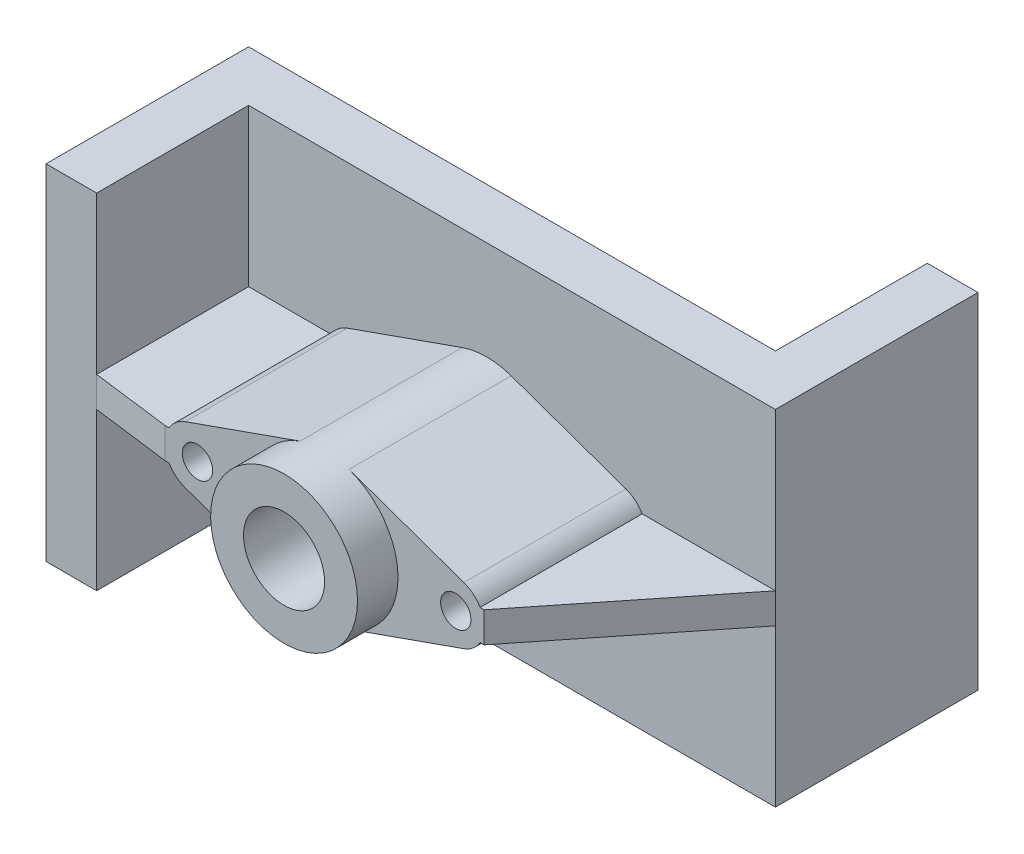
ISO-10303-21;
HEADER;
FILE_DESCRIPTION(('STEP AP214'),'2;1');
FILE_NAME('part.step','',(''),(''),'','','');
FILE_SCHEMA(('AUTOMOTIVE_DESIGN { 1 0 10303 214 1 1 1 1 }'));
ENDSEC;
DATA;
#1=APPLICATION_CONTEXT('core data for automotive mechanical design processes');
#2=APPLICATION_PROTOCOL_DEFINITION('international standard','automotive_design',2000,#1);
#3=PRODUCT_CONTEXT('',#1,'mechanical');
#4=PRODUCT('Part','Part','',(#3));
#5=PRODUCT_RELATED_PRODUCT_CATEGORY('part','',(#4));
#6=PRODUCT_DEFINITION_FORMATION('','',#4);
#7=PRODUCT_DEFINITION_CONTEXT('part definition',#1,'design');
#8=PRODUCT_DEFINITION('design','',#6,#7);
#9=PRODUCT_DEFINITION_SHAPE('','',#8);
#10=(LENGTH_UNIT() NAMED_UNIT(*) SI_UNIT(.MILLI.,.METRE.));
#11=(NAMED_UNIT(*) PLANE_ANGLE_UNIT() SI_UNIT($,.RADIAN.));
#12=(NAMED_UNIT(*) SI_UNIT($,.STERADIAN.) SOLID_ANGLE_UNIT());
#13=UNCERTAINTY_MEASURE_WITH_UNIT(LENGTH_MEASURE(1.E-05),#10,'distance_accuracy_value','');
#14=(GEOMETRIC_REPRESENTATION_CONTEXT(3) GLOBAL_UNCERTAINTY_ASSIGNED_CONTEXT((#13)) GLOBAL_UNIT_ASSIGNED_CONTEXT((#10,
#11,#12)) REPRESENTATION_CONTEXT('',''));
#15=CARTESIAN_POINT('',(0.,0.,0.));
#16=DIRECTION('',(0.,0.,1.));
#17=DIRECTION('',(1.,0.,0.));
#18=AXIS2_PLACEMENT_3D('',#15,#16,#17);
#19=CARTESIAN_POINT('',(-47.,34.,-10.));
#20=DIRECTION('',(0.,0.,-1.));
#21=DIRECTION('',(-1.,0.,0.));
#22=AXIS2_PLACEMENT_3D('',#19,#20,#21);
#23=PLANE('',#22);
#24=DIRECTION('',(1.,0.,0.));
#25=VECTOR('',#24,1.);
#26=CARTESIAN_POINT('',(-47.,-3.,-10.));
#27=LINE('',#26,#25);
#28=CARTESIAN_POINT('',(-47.,-3.,-10.));
#29=VERTEX_POINT('',#28);
#30=CARTESIAN_POINT('',(-30.6961524227066,-3.,-10.));
#31=VERTEX_POINT('',#30);
#32=EDGE_CURVE('E53',#29,#31,#27,.T.);
#33=ORIENTED_EDGE('',*,*,#32,.F.);
#34=DIRECTION('',(0.,-1.,0.));
#35=VECTOR('',#34,1.);
#36=CARTESIAN_POINT('',(-47.,34.,-10.));
#37=LINE('',#36,#35);
#38=CARTESIAN_POINT('',(-47.,-34.,-10.));
#39=VERTEX_POINT('',#38);
#40=EDGE_CURVE('E407',#29,#39,#37,.T.);
#41=ORIENTED_EDGE('',*,*,#40,.T.);
#42=DIRECTION('',(1.,0.,0.));
#43=VECTOR('',#42,1.);
#44=CARTESIAN_POINT('',(-47.,-34.,-10.));
#45=LINE('',#44,#43);
#46=CARTESIAN_POINT('',(57.,-34.,-10.));
#47=VERTEX_POINT('',#46);
#48=EDGE_CURVE('E387',#39,#47,#45,.T.);
#49=ORIENTED_EDGE('',*,*,#48,.T.);
#50=DIRECTION('',(0.,-1.,0.));
#51=VECTOR('',#50,1.);
#52=CARTESIAN_POINT('',(57.,34.,-10.));
#53=LINE('',#52,#51);
#54=CARTESIAN_POINT('',(57.,-3.,-10.));
#55=VERTEX_POINT('',#54);
#56=EDGE_CURVE('E403',#55,#47,#53,.T.);
#57=ORIENTED_EDGE('',*,*,#56,.F.);
#58=DIRECTION('',(1.,0.,0.));
#59=VECTOR('',#58,1.);
#60=CARTESIAN_POINT('',(-47.,-3.,-10.));
#61=LINE('',#60,#59);
#62=CARTESIAN_POINT('',(30.6961524227066,-3.,-10.));
#63=VERTEX_POINT('',#62);
#64=EDGE_CURVE('E262',#63,#55,#61,.T.);
#65=ORIENTED_EDGE('',*,*,#64,.F.);
#66=CARTESIAN_POINT('',(25.5,0.,-10.));
#67=DIRECTION('',(0.,0.,1.));
#68=DIRECTION('',(1.,0.,0.));
#69=AXIS2_PLACEMENT_3D('',#66,#67,#68);
#70=CIRCLE('',#69,6.);
#71=CARTESIAN_POINT('',(27.5,-5.65685424949238,-10.));
#72=VERTEX_POINT('',#71);
#73=EDGE_CURVE('E321',#72,#63,#70,.T.);
#74=ORIENTED_EDGE('',*,*,#73,.F.);
#75=DIRECTION('',(0.942809041582063,0.333333333333333,0.));
#76=VECTOR('',#75,1.);
#77=CARTESIAN_POINT('',(4.83333333333333,-13.6707311029399,-10.));
#78=LINE('',#77,#76);
#79=CARTESIAN_POINT('',(4.83333333333333,-13.6707311029399,-10.));
#80=VERTEX_POINT('',#79);
#81=EDGE_CURVE('E317',#80,#72,#78,.T.);
#82=ORIENTED_EDGE('',*,*,#81,.F.);
#83=CARTESIAN_POINT('',(0.,0.,-10.));
#84=DIRECTION('',(0.,0.,1.));
#85=DIRECTION('',(1.,0.,0.));
#86=AXIS2_PLACEMENT_3D('',#83,#84,#85);
#87=CIRCLE('',#86,14.5);
#88=CARTESIAN_POINT('',(-4.83333333333334,-13.6707311029399,-10.));
#89=VERTEX_POINT('',#88);
#90=EDGE_CURVE('E314',#89,#80,#87,.T.);
#91=ORIENTED_EDGE('',*,*,#90,.F.);
#92=DIRECTION('',(0.942809041582063,-0.333333333333333,0.));
#93=VECTOR('',#92,1.);
#94=CARTESIAN_POINT('',(-27.5,-5.65685424949238,-10.));
#95=LINE('',#94,#93);
#96=CARTESIAN_POINT('',(-27.5,-5.65685424949238,-10.));
#97=VERTEX_POINT('',#96);
#98=EDGE_CURVE('E311',#97,#89,#95,.T.);
#99=ORIENTED_EDGE('',*,*,#98,.F.);
#100=CARTESIAN_POINT('',(-25.5,0.,-10.));
#101=DIRECTION('',(0.,0.,1.));
#102=DIRECTION('',(1.,0.,0.));
#103=AXIS2_PLACEMENT_3D('',#100,#101,#102);
#104=CIRCLE('',#103,6.);
#105=EDGE_CURVE('E290',#31,#97,#104,.T.);
#106=ORIENTED_EDGE('',*,*,#105,.F.);
#107=EDGE_LOOP('',(#33,#41,#49,#57,#65,#74,#82,#91,#99,#106));
#108=FACE_BOUND('',#107,.T.);
#109=ADVANCED_FACE('F36',(#108),#23,.F.);
#110=CARTESIAN_POINT('',(-47.,34.,20.));
#111=DIRECTION('',(-1.,0.,0.));
#112=DIRECTION('',(0.,0.,1.));
#113=AXIS2_PLACEMENT_3D('',#110,#111,#112);
#114=PLANE('',#113);
#115=DIRECTION('',(0.,0.,-1.));
#116=VECTOR('',#115,1.);
#117=CARTESIAN_POINT('',(-47.,-3.,20.));
#118=LINE('',#117,#116);
#119=CARTESIAN_POINT('',(-47.,-3.,20.));
#120=VERTEX_POINT('',#119);
#121=EDGE_CURVE('E240',#120,#29,#118,.T.);
#122=ORIENTED_EDGE('',*,*,#121,.F.);
#123=DIRECTION('',(0.,-1.,0.));
#124=VECTOR('',#123,1.);
#125=CARTESIAN_POINT('',(-47.,34.,20.));
#126=LINE('',#125,#124);
#127=CARTESIAN_POINT('',(-47.,-34.,20.));
#128=VERTEX_POINT('',#127);
#129=EDGE_CURVE('E410',#120,#128,#126,.T.);
#130=ORIENTED_EDGE('',*,*,#129,.T.);
#131=DIRECTION('',(0.,0.,-1.));
#132=VECTOR('',#131,1.);
#133=CARTESIAN_POINT('',(-47.,-34.,20.));
#134=LINE('',#133,#132);
#135=EDGE_CURVE('E384',#128,#39,#134,.T.);
#136=ORIENTED_EDGE('',*,*,#135,.T.);
#137=ORIENTED_EDGE('',*,*,#40,.F.);
#138=EDGE_LOOP('',(#122,#130,#136,#137));
#139=FACE_BOUND('',#138,.T.);
#140=ADVANCED_FACE('F498',(#139),#114,.F.);
#141=CARTESIAN_POINT('',(-25.5,0.,22.));
#142=DIRECTION('',(0.,0.,-1.));
#143=DIRECTION('',(-1.,0.,0.));
#144=AXIS2_PLACEMENT_3D('',#141,#142,#143);
#145=CYLINDRICAL_SURFACE('',#144,6.);
#146=DIRECTION('',(0.,0.,-1.));
#147=VECTOR('',#146,1.);
#148=CARTESIAN_POINT('',(-30.6961524227066,-3.,22.));
#149=LINE('',#148,#147);
#150=CARTESIAN_POINT('',(-30.6961524227066,-3.,22.));
#151=VERTEX_POINT('',#150);
#152=EDGE_CURVE('E218',#31,#151,#149,.F.);
#153=ORIENTED_EDGE('',*,*,#152,.F.);
#154=ORIENTED_EDGE('',*,*,#105,.T.);
#155=DIRECTION('',(0.,0.,-1.));
#156=VECTOR('',#155,1.);
#157=CARTESIAN_POINT('',(-27.5,-5.65685424949238,22.));
#158=LINE('',#157,#156);
#159=CARTESIAN_POINT('',(-27.5,-5.65685424949238,22.));
#160=VERTEX_POINT('',#159);
#161=EDGE_CURVE('E353',#160,#97,#158,.T.);
#162=ORIENTED_EDGE('',*,*,#161,.F.);
#163=CARTESIAN_POINT('',(-25.5,0.,22.));
#164=DIRECTION('',(0.,0.,1.));
#165=DIRECTION('',(1.,0.,0.));
#166=AXIS2_PLACEMENT_3D('',#163,#164,#165);
#167=CIRCLE('',#166,6.);
#168=EDGE_CURVE('E294',#151,#160,#167,.T.);
#169=ORIENTED_EDGE('',*,*,#168,.F.);
#170=EDGE_LOOP('',(#153,#154,#162,#169));
#171=FACE_BOUND('',#170,.T.);
#172=ADVANCED_FACE('F486',(#171),#145,.T.);
#173=CARTESIAN_POINT('',(25.5,0.,22.));
#174=DIRECTION('',(0.,0.,-1.));
#175=DIRECTION('',(-1.,0.,0.));
#176=AXIS2_PLACEMENT_3D('',#173,#174,#175);
#177=CYLINDRICAL_SURFACE('',#176,6.);
#178=DIRECTION('',(0.,0.,-1.));
#179=VECTOR('',#178,1.);
#180=CARTESIAN_POINT('',(30.6961524227066,-3.,22.));
#181=LINE('',#180,#179);
#182=CARTESIAN_POINT('',(30.6961524227066,-3.,22.));
#183=VERTEX_POINT('',#182);
#184=EDGE_CURVE('E261',#183,#63,#181,.T.);
#185=ORIENTED_EDGE('',*,*,#184,.F.);
#186=CARTESIAN_POINT('',(25.5,0.,22.));
#187=DIRECTION('',(0.,0.,1.));
#188=DIRECTION('',(1.,0.,0.));
#189=AXIS2_PLACEMENT_3D('',#186,#187,#188);
#190=CIRCLE('',#189,6.);
#191=CARTESIAN_POINT('',(27.5,-5.65685424949238,22.));
#192=VERTEX_POINT('',#191);
#193=EDGE_CURVE('E299',#192,#183,#190,.T.);
#194=ORIENTED_EDGE('',*,*,#193,.F.);
#195=DIRECTION('',(0.,0.,-1.));
#196=VECTOR('',#195,1.);
#197=CARTESIAN_POINT('',(27.5,-5.65685424949238,22.));
#198=LINE('',#197,#196);
#199=EDGE_CURVE('E344',#192,#72,#198,.T.);
#200=ORIENTED_EDGE('',*,*,#199,.T.);
#201=ORIENTED_EDGE('',*,*,#73,.T.);
#202=EDGE_LOOP('',(#185,#194,#200,#201));
#203=FACE_BOUND('',#202,.T.);
#204=ADVANCED_FACE('F457',(#203),#177,.T.);
#205=CARTESIAN_POINT('',(-25.5,0.,22.));
#206=DIRECTION('',(0.,0.,1.));
#207=DIRECTION('',(1.,0.,0.));
#208=AXIS2_PLACEMENT_3D('',#205,#206,#207);
#209=PLANE('',#208);
#210=CARTESIAN_POINT('',(-25.1,0.,22.));
#211=DIRECTION('',(0.,0.,1.));
#212=DIRECTION('',(1.,0.,0.));
#213=AXIS2_PLACEMENT_3D('',#210,#211,#212);
#214=CIRCLE('',#213,3.);
#215=CARTESIAN_POINT('',(-22.1,0.,22.));
#216=VERTEX_POINT('',#215);
#217=EDGE_CURVE('E274',#216,#216,#214,.T.);
#218=ORIENTED_EDGE('',*,*,#217,.F.);
#219=EDGE_LOOP('',(#218));
#220=FACE_BOUND('',#219,.T.);
#221=DIRECTION('',(0.942809041582063,-0.333333333333333,0.));
#222=VECTOR('',#221,1.);
#223=CARTESIAN_POINT('',(-27.5,-5.65685424949238,22.));
#224=LINE('',#223,#222);
#225=CARTESIAN_POINT('',(-4.83333333333334,-13.6707311029399,22.));
#226=VERTEX_POINT('',#225);
#227=EDGE_CURVE('E293',#160,#226,#224,.T.);
#228=ORIENTED_EDGE('',*,*,#227,.T.);
#229=CARTESIAN_POINT('',(0.,0.,22.));
#230=DIRECTION('',(0.,0.,1.));
#231=DIRECTION('',(1.,0.,0.));
#232=AXIS2_PLACEMENT_3D('',#229,#230,#231);
#233=CIRCLE('',#232,14.5);
#234=CARTESIAN_POINT('',(-4.83333333333334,13.6707311029399,22.));
#235=VERTEX_POINT('',#234);
#236=EDGE_CURVE('E11',#235,#226,#233,.T.);
#237=ORIENTED_EDGE('',*,*,#236,.F.);
#238=DIRECTION('',(-0.942809041582063,-0.333333333333334,0.));
#239=VECTOR('',#238,1.);
#240=CARTESIAN_POINT('',(-27.5,5.65685424949238,22.));
#241=LINE('',#240,#239);
#242=CARTESIAN_POINT('',(-27.5,5.65685424949238,22.));
#243=VERTEX_POINT('',#242);
#244=EDGE_CURVE('E305',#235,#243,#241,.T.);
#245=ORIENTED_EDGE('',*,*,#244,.T.);
#246=CARTESIAN_POINT('',(-30.6961524227066,3.,22.));
#247=VERTEX_POINT('',#246);
#248=EDGE_CURVE('E231',#243,#247,#167,.T.);
#249=ORIENTED_EDGE('',*,*,#248,.T.);
#250=DIRECTION('',(1.,0.,0.));
#251=VECTOR('',#250,1.);
#252=CARTESIAN_POINT('',(0.,3.,22.));
#253=LINE('',#252,#251);
#254=CARTESIAN_POINT('',(-31.5,3.,22.));
#255=VERTEX_POINT('',#254);
#256=EDGE_CURVE('E224',#255,#247,#253,.T.);
#257=ORIENTED_EDGE('',*,*,#256,.F.);
#258=DIRECTION('',(0.,1.,0.));
#259=VECTOR('',#258,1.);
#260=CARTESIAN_POINT('',(-31.5,0.,22.));
#261=LINE('',#260,#259);
#262=CARTESIAN_POINT('',(-31.5,-3.,22.));
#263=VERTEX_POINT('',#262);
#264=EDGE_CURVE('E207',#263,#255,#261,.T.);
#265=ORIENTED_EDGE('',*,*,#264,.F.);
#266=DIRECTION('',(1.,0.,0.));
#267=VECTOR('',#266,1.);
#268=CARTESIAN_POINT('',(0.,-3.,22.));
#269=LINE('',#268,#267);
#270=EDGE_CURVE('E233',#263,#151,#269,.T.);
#271=ORIENTED_EDGE('',*,*,#270,.T.);
#272=ORIENTED_EDGE('',*,*,#168,.T.);
#273=EDGE_LOOP('',(#228,#237,#245,#249,#257,#265,#271,#272));
#274=FACE_BOUND('',#273,.T.);
#275=ADVANCED_FACE('F229',(#220,#274),#209,.T.);
#276=CARTESIAN_POINT('',(-47.,34.,-10.));
#277=VERTEX_POINT('',#276);
#278=CARTESIAN_POINT('',(-47.,3.,-10.));
#279=VERTEX_POINT('',#278);
#280=EDGE_CURVE('E408',#277,#279,#37,.T.);
#281=ORIENTED_EDGE('',*,*,#280,.T.);
#282=DIRECTION('',(1.,0.,0.));
#283=VECTOR('',#282,1.);
#284=CARTESIAN_POINT('',(-47.,3.,-10.));
#285=LINE('',#284,#283);
#286=CARTESIAN_POINT('',(-30.6961524227066,3.,-10.));
#287=VERTEX_POINT('',#286);
#288=EDGE_CURVE('E245',#279,#287,#285,.T.);
#289=ORIENTED_EDGE('',*,*,#288,.T.);
#290=CARTESIAN_POINT('',(-27.5,5.65685424949238,-10.));
#291=VERTEX_POINT('',#290);
#292=EDGE_CURVE('E308',#291,#287,#104,.T.);
#293=ORIENTED_EDGE('',*,*,#292,.F.);
#294=DIRECTION('',(-0.942809041582063,-0.333333333333334,0.));
#295=VECTOR('',#294,1.);
#296=CARTESIAN_POINT('',(-27.5,5.65685424949238,-10.));
#297=LINE('',#296,#295);
#298=CARTESIAN_POINT('',(-4.83333333333334,13.6707311029399,-10.));
#299=VERTEX_POINT('',#298);
#300=EDGE_CURVE('E330',#299,#291,#297,.T.);
#301=ORIENTED_EDGE('',*,*,#300,.F.);
#302=CARTESIAN_POINT('',(0.,0.,-10.));
#303=DIRECTION('',(0.,0.,1.));
#304=DIRECTION('',(1.,0.,0.));
#305=AXIS2_PLACEMENT_3D('',#302,#303,#304);
#306=CIRCLE('',#305,14.5);
#307=CARTESIAN_POINT('',(4.83333333333333,13.6707311029399,-10.));
#308=VERTEX_POINT('',#307);
#309=EDGE_CURVE('E327',#308,#299,#306,.T.);
#310=ORIENTED_EDGE('',*,*,#309,.F.);
#311=DIRECTION('',(-0.942809041582063,0.333333333333333,0.));
#312=VECTOR('',#311,1.);
#313=CARTESIAN_POINT('',(4.83333333333333,13.6707311029399,-10.));
#314=LINE('',#313,#312);
#315=CARTESIAN_POINT('',(27.5,5.65685424949238,-10.));
#316=VERTEX_POINT('',#315);
#317=EDGE_CURVE('E324',#316,#308,#314,.T.);
#318=ORIENTED_EDGE('',*,*,#317,.F.);
#319=CARTESIAN_POINT('',(30.6961524227066,3.,-10.));
#320=VERTEX_POINT('',#319);
#321=EDGE_CURVE('E320',#320,#316,#70,.T.);
#322=ORIENTED_EDGE('',*,*,#321,.F.);
#323=DIRECTION('',(1.,0.,0.));
#324=VECTOR('',#323,1.);
#325=CARTESIAN_POINT('',(-47.,3.,-10.));
#326=LINE('',#325,#324);
#327=CARTESIAN_POINT('',(57.,3.,-10.));
#328=VERTEX_POINT('',#327);
#329=EDGE_CURVE('E266',#320,#328,#326,.T.);
#330=ORIENTED_EDGE('',*,*,#329,.T.);
#331=CARTESIAN_POINT('',(57.,34.,-10.));
#332=VERTEX_POINT('',#331);
#333=EDGE_CURVE('E404',#332,#328,#53,.T.);
#334=ORIENTED_EDGE('',*,*,#333,.F.);
#335=DIRECTION('',(1.,0.,0.));
#336=VECTOR('',#335,1.);
#337=CARTESIAN_POINT('',(-47.,34.,-10.));
#338=LINE('',#337,#336);
#339=EDGE_CURVE('E367',#277,#332,#338,.T.);
#340=ORIENTED_EDGE('',*,*,#339,.F.);
#341=EDGE_LOOP('',(#281,#289,#293,#301,#310,#318,#322,#330,#334,#340));
#342=FACE_BOUND('',#341,.T.);
#343=ADVANCED_FACE('F438',(#342),#23,.F.);
#344=CARTESIAN_POINT('',(-57.,34.,-20.));
#345=DIRECTION('',(0.,0.,1.));
#346=DIRECTION('',(1.,0.,0.));
#347=AXIS2_PLACEMENT_3D('',#344,#345,#346);
#348=PLANE('',#347);
#349=CARTESIAN_POINT('',(25.9,0.,-20.));
#350=DIRECTION('',(0.,0.,1.));
#351=DIRECTION('',(1.,0.,0.));
#352=AXIS2_PLACEMENT_3D('',#349,#350,#351);
#353=CIRCLE('',#352,3.);
#354=CARTESIAN_POINT('',(28.9,0.,-20.));
#355=VERTEX_POINT('',#354);
#356=EDGE_CURVE('E277',#355,#355,#353,.T.);
#357=ORIENTED_EDGE('',*,*,#356,.T.);
#358=EDGE_LOOP('',(#357));
#359=FACE_BOUND('',#358,.T.);
#360=CARTESIAN_POINT('',(0.,0.,-20.));
#361=DIRECTION('',(0.,0.,1.));
#362=DIRECTION('',(1.,0.,0.));
#363=AXIS2_PLACEMENT_3D('',#360,#361,#362);
#364=CIRCLE('',#363,8.);
#365=CARTESIAN_POINT('',(8.,0.,-20.));
#366=VERTEX_POINT('',#365);
#367=EDGE_CURVE('E285',#366,#366,#364,.T.);
#368=ORIENTED_EDGE('',*,*,#367,.T.);
#369=EDGE_LOOP('',(#368));
#370=FACE_BOUND('',#369,.T.);
#371=CARTESIAN_POINT('',(-25.1,0.,-20.));
#372=DIRECTION('',(0.,0.,1.));
#373=DIRECTION('',(1.,0.,0.));
#374=AXIS2_PLACEMENT_3D('',#371,#372,#373);
#375=CIRCLE('',#374,3.);
#376=CARTESIAN_POINT('',(-22.1,0.,-20.));
#377=VERTEX_POINT('',#376);
#378=EDGE_CURVE('E40',#377,#377,#375,.T.);
#379=ORIENTED_EDGE('',*,*,#378,.T.);
#380=EDGE_LOOP('',(#379));
#381=FACE_BOUND('',#380,.T.);
#382=DIRECTION('',(0.,-1.,0.));
#383=VECTOR('',#382,1.);
#384=CARTESIAN_POINT('',(47.,34.,-20.));
#385=LINE('',#384,#383);
#386=CARTESIAN_POINT('',(47.,34.,-20.));
#387=VERTEX_POINT('',#386);
#388=CARTESIAN_POINT('',(47.,-34.,-20.));
#389=VERTEX_POINT('',#388);
#390=EDGE_CURVE('E375',#387,#389,#385,.T.);
#391=ORIENTED_EDGE('',*,*,#390,.T.);
#392=DIRECTION('',(-1.,0.,0.));
#393=VECTOR('',#392,1.);
#394=CARTESIAN_POINT('',(-57.,-34.,-20.));
#395=LINE('',#394,#393);
#396=CARTESIAN_POINT('',(-57.,-34.,-20.));
#397=VERTEX_POINT('',#396);
#398=EDGE_CURVE('E356',#389,#397,#395,.T.);
#399=ORIENTED_EDGE('',*,*,#398,.T.);
#400=DIRECTION('',(0.,-1.,0.));
#401=VECTOR('',#400,1.);
#402=CARTESIAN_POINT('',(-57.,34.,-20.));
#403=LINE('',#402,#401);
#404=CARTESIAN_POINT('',(-57.,34.,-20.));
#405=VERTEX_POINT('',#404);
#406=EDGE_CURVE('E414',#405,#397,#403,.T.);
#407=ORIENTED_EDGE('',*,*,#406,.F.);
#408=DIRECTION('',(-1.,0.,0.));
#409=VECTOR('',#408,1.);
#410=CARTESIAN_POINT('',(-57.,34.,-20.));
#411=LINE('',#410,#409);
#412=EDGE_CURVE('E357',#387,#405,#411,.T.);
#413=ORIENTED_EDGE('',*,*,#412,.F.);
#414=EDGE_LOOP('',(#391,#399,#407,#413));
#415=FACE_BOUND('',#414,.T.);
#416=ADVANCED_FACE('F38',(#359,#370,#381,#415),#348,.F.);
#417=CARTESIAN_POINT('',(-57.,34.,-20.));
#418=DIRECTION('',(1.,0.,0.));
#419=DIRECTION('',(0.,0.,-1.));
#420=AXIS2_PLACEMENT_3D('',#417,#418,#419);
#421=PLANE('',#420);
#422=ORIENTED_EDGE('',*,*,#406,.T.);
#423=DIRECTION('',(0.,0.,1.));
#424=VECTOR('',#423,1.);
#425=CARTESIAN_POINT('',(-57.,-34.,-20.));
#426=LINE('',#425,#424);
#427=CARTESIAN_POINT('',(-57.,-34.,20.));
#428=VERTEX_POINT('',#427);
#429=EDGE_CURVE('E378',#397,#428,#426,.T.);
#430=ORIENTED_EDGE('',*,*,#429,.T.);
#431=DIRECTION('',(0.,-1.,0.));
#432=VECTOR('',#431,1.);
#433=CARTESIAN_POINT('',(-57.,34.,20.));
#434=LINE('',#433,#432);
#435=CARTESIAN_POINT('',(-57.,34.,20.));
#436=VERTEX_POINT('',#435);
#437=EDGE_CURVE('E413',#436,#428,#434,.T.);
#438=ORIENTED_EDGE('',*,*,#437,.F.);
#439=DIRECTION('',(0.,0.,1.));
#440=VECTOR('',#439,1.);
#441=CARTESIAN_POINT('',(-57.,34.,-20.));
#442=LINE('',#441,#440);
#443=EDGE_CURVE('E360',#405,#436,#442,.T.);
#444=ORIENTED_EDGE('',*,*,#443,.F.);
#445=EDGE_LOOP('',(#422,#430,#438,#444));
#446=FACE_BOUND('',#445,.T.);
#447=ADVANCED_FACE('F515',(#446),#421,.F.);
#448=CARTESIAN_POINT('',(-57.,34.,20.));
#449=DIRECTION('',(0.,0.,-1.));
#450=DIRECTION('',(-1.,0.,0.));
#451=AXIS2_PLACEMENT_3D('',#448,#449,#450);
#452=PLANE('',#451);
#453=ORIENTED_EDGE('',*,*,#437,.T.);
#454=DIRECTION('',(1.,0.,0.));
#455=VECTOR('',#454,1.);
#456=CARTESIAN_POINT('',(-57.,-34.,20.));
#457=LINE('',#456,#455);
#458=EDGE_CURVE('E381',#428,#128,#457,.T.);
#459=ORIENTED_EDGE('',*,*,#458,.T.);
#460=ORIENTED_EDGE('',*,*,#129,.F.);
#461=DIRECTION('',(0.,1.,0.));
#462=VECTOR('',#461,1.);
#463=CARTESIAN_POINT('',(-47.,34.,20.));
#464=LINE('',#463,#462);
#465=CARTESIAN_POINT('',(-47.,3.,20.));
#466=VERTEX_POINT('',#465);
#467=EDGE_CURVE('E248',#120,#466,#464,.T.);
#468=ORIENTED_EDGE('',*,*,#467,.T.);
#469=CARTESIAN_POINT('',(-47.,34.,20.));
#470=VERTEX_POINT('',#469);
#471=EDGE_CURVE('E411',#470,#466,#126,.T.);
#472=ORIENTED_EDGE('',*,*,#471,.F.);
#473=DIRECTION('',(1.,0.,0.));
#474=VECTOR('',#473,1.);
#475=CARTESIAN_POINT('',(-57.,34.,20.));
#476=LINE('',#475,#474);
#477=EDGE_CURVE('E363',#436,#470,#476,.T.);
#478=ORIENTED_EDGE('',*,*,#477,.F.);
#479=EDGE_LOOP('',(#453,#459,#460,#468,#472,#478));
#480=FACE_BOUND('',#479,.T.);
#481=ADVANCED_FACE('F792',(#480),#452,.F.);
#482=ORIENTED_EDGE('',*,*,#471,.T.);
#483=DIRECTION('',(0.,0.,-1.));
#484=VECTOR('',#483,1.);
#485=CARTESIAN_POINT('',(-47.,3.,20.));
#486=LINE('',#485,#484);
#487=EDGE_CURVE('E61',#466,#279,#486,.T.);
#488=ORIENTED_EDGE('',*,*,#487,.T.);
#489=ORIENTED_EDGE('',*,*,#280,.F.);
#490=DIRECTION('',(0.,0.,-1.));
#491=VECTOR('',#490,1.);
#492=CARTESIAN_POINT('',(-47.,34.,20.));
#493=LINE('',#492,#491);
#494=EDGE_CURVE('E365',#470,#277,#493,.T.);
#495=ORIENTED_EDGE('',*,*,#494,.F.);
#496=EDGE_LOOP('',(#482,#488,#489,#495));
#497=FACE_BOUND('',#496,.T.);
#498=ADVANCED_FACE('F508',(#497),#114,.F.);
#499=CARTESIAN_POINT('',(57.,34.,-10.));
#500=DIRECTION('',(-1.,0.,0.));
#501=DIRECTION('',(0.,0.,1.));
#502=AXIS2_PLACEMENT_3D('',#499,#500,#501);
#503=PLANE('',#502);
#504=ORIENTED_EDGE('',*,*,#333,.T.);
#505=DIRECTION('',(0.,-1.,0.));
#506=VECTOR('',#505,1.);
#507=CARTESIAN_POINT('',(57.,34.,-10.));
#508=LINE('',#507,#506);
#509=EDGE_CURVE('E269',#55,#328,#508,.F.);
#510=ORIENTED_EDGE('',*,*,#509,.F.);
#511=ORIENTED_EDGE('',*,*,#56,.T.);
#512=DIRECTION('',(0.,0.,-1.));
#513=VECTOR('',#512,1.);
#514=CARTESIAN_POINT('',(57.,-34.,-10.));
#515=LINE('',#514,#513);
#516=CARTESIAN_POINT('',(57.,-34.,-50.));
#517=VERTEX_POINT('',#516);
#518=EDGE_CURVE('E390',#47,#517,#515,.T.);
#519=ORIENTED_EDGE('',*,*,#518,.T.);
#520=DIRECTION('',(0.,-1.,0.));
#521=VECTOR('',#520,1.);
#522=CARTESIAN_POINT('',(57.,34.,-50.));
#523=LINE('',#522,#521);
#524=CARTESIAN_POINT('',(57.,34.,-50.));
#525=VERTEX_POINT('',#524);
#526=EDGE_CURVE('E401',#525,#517,#523,.T.);
#527=ORIENTED_EDGE('',*,*,#526,.F.);
#528=DIRECTION('',(0.,0.,-1.));
#529=VECTOR('',#528,1.);
#530=CARTESIAN_POINT('',(57.,34.,-10.));
#531=LINE('',#530,#529);
#532=EDGE_CURVE('E369',#332,#525,#531,.T.);
#533=ORIENTED_EDGE('',*,*,#532,.F.);
#534=EDGE_LOOP('',(#504,#510,#511,#519,#527,#533));
#535=FACE_BOUND('',#534,.T.);
#536=ADVANCED_FACE('F474',(#535),#503,.F.);
#537=CARTESIAN_POINT('',(57.,34.,-50.));
#538=DIRECTION('',(0.,0.,1.));
#539=DIRECTION('',(1.,0.,0.));
#540=AXIS2_PLACEMENT_3D('',#537,#538,#539);
#541=PLANE('',#540);
#542=ORIENTED_EDGE('',*,*,#526,.T.);
#543=DIRECTION('',(-1.,0.,0.));
#544=VECTOR('',#543,1.);
#545=CARTESIAN_POINT('',(57.,-34.,-50.));
#546=LINE('',#545,#544);
#547=CARTESIAN_POINT('',(47.,-34.,-50.));
#548=VERTEX_POINT('',#547);
#549=EDGE_CURVE('E393',#517,#548,#546,.T.);
#550=ORIENTED_EDGE('',*,*,#549,.T.);
#551=DIRECTION('',(0.,-1.,0.));
#552=VECTOR('',#551,1.);
#553=CARTESIAN_POINT('',(47.,34.,-50.));
#554=LINE('',#553,#552);
#555=CARTESIAN_POINT('',(47.,34.,-50.));
#556=VERTEX_POINT('',#555);
#557=EDGE_CURVE('E399',#556,#548,#554,.T.);
#558=ORIENTED_EDGE('',*,*,#557,.F.);
#559=DIRECTION('',(-1.,0.,0.));
#560=VECTOR('',#559,1.);
#561=CARTESIAN_POINT('',(57.,34.,-50.));
#562=LINE('',#561,#560);
#563=EDGE_CURVE('E371',#525,#556,#562,.T.);
#564=ORIENTED_EDGE('',*,*,#563,.F.);
#565=EDGE_LOOP('',(#542,#550,#558,#564));
#566=FACE_BOUND('',#565,.T.);
#567=ADVANCED_FACE('F766',(#566),#541,.F.);
#568=CARTESIAN_POINT('',(47.,34.,-50.));
#569=DIRECTION('',(1.,0.,0.));
#570=DIRECTION('',(0.,0.,-1.));
#571=AXIS2_PLACEMENT_3D('',#568,#569,#570);
#572=PLANE('',#571);
#573=ORIENTED_EDGE('',*,*,#557,.T.);
#574=DIRECTION('',(0.,0.,1.));
#575=VECTOR('',#574,1.);
#576=CARTESIAN_POINT('',(47.,-34.,-50.));
#577=LINE('',#576,#575);
#578=EDGE_CURVE('E361',#548,#389,#577,.T.);
#579=ORIENTED_EDGE('',*,*,#578,.T.);
#580=ORIENTED_EDGE('',*,*,#390,.F.);
#581=DIRECTION('',(0.,0.,1.));
#582=VECTOR('',#581,1.);
#583=CARTESIAN_POINT('',(47.,34.,-50.));
#584=LINE('',#583,#582);
#585=EDGE_CURVE('E373',#556,#387,#584,.T.);
#586=ORIENTED_EDGE('',*,*,#585,.F.);
#587=EDGE_LOOP('',(#573,#579,#580,#586));
#588=FACE_BOUND('',#587,.T.);
#589=ADVANCED_FACE('F759',(#588),#572,.F.);
#590=CARTESIAN_POINT('',(0.,34.,0.));
#591=DIRECTION('',(0.,-1.,0.));
#592=DIRECTION('',(0.,0.,-1.));
#593=AXIS2_PLACEMENT_3D('',#590,#591,#592);
#594=PLANE('',#593);
#595=ORIENTED_EDGE('',*,*,#412,.T.);
#596=ORIENTED_EDGE('',*,*,#443,.T.);
#597=ORIENTED_EDGE('',*,*,#477,.T.);
#598=ORIENTED_EDGE('',*,*,#494,.T.);
#599=ORIENTED_EDGE('',*,*,#339,.T.);
#600=ORIENTED_EDGE('',*,*,#532,.T.);
#601=ORIENTED_EDGE('',*,*,#563,.T.);
#602=ORIENTED_EDGE('',*,*,#585,.T.);
#603=EDGE_LOOP('',(#595,#596,#597,#598,#599,#600,#601,#602));
#604=FACE_BOUND('',#603,.T.);
#605=ADVANCED_FACE('F478',(#604),#594,.F.);
#606=CARTESIAN_POINT('',(0.,-34.,0.));
#607=DIRECTION('',(0.,-1.,0.));
#608=DIRECTION('',(0.,0.,-1.));
#609=AXIS2_PLACEMENT_3D('',#606,#607,#608);
#610=PLANE('',#609);
#611=ORIENTED_EDGE('',*,*,#398,.F.);
#612=ORIENTED_EDGE('',*,*,#578,.F.);
#613=ORIENTED_EDGE('',*,*,#549,.F.);
#614=ORIENTED_EDGE('',*,*,#518,.F.);
#615=ORIENTED_EDGE('',*,*,#48,.F.);
#616=ORIENTED_EDGE('',*,*,#135,.F.);
#617=ORIENTED_EDGE('',*,*,#458,.F.);
#618=ORIENTED_EDGE('',*,*,#429,.F.);
#619=EDGE_LOOP('',(#611,#612,#613,#614,#615,#616,#617,#618));
#620=FACE_BOUND('',#619,.T.);
#621=ADVANCED_FACE('F484',(#620),#610,.T.);
#622=ORIENTED_EDGE('',*,*,#292,.T.);
#623=DIRECTION('',(0.,0.,-1.));
#624=VECTOR('',#623,1.);
#625=CARTESIAN_POINT('',(-30.6961524227066,3.,22.));
#626=LINE('',#625,#624);
#627=EDGE_CURVE('E243',#287,#247,#626,.F.);
#628=ORIENTED_EDGE('',*,*,#627,.T.);
#629=ORIENTED_EDGE('',*,*,#248,.F.);
#630=DIRECTION('',(0.,0.,-1.));
#631=VECTOR('',#630,1.);
#632=CARTESIAN_POINT('',(-27.5,5.65685424949238,22.));
#633=LINE('',#632,#631);
#634=EDGE_CURVE('E307',#243,#291,#633,.T.);
#635=ORIENTED_EDGE('',*,*,#634,.T.);
#636=EDGE_LOOP('',(#622,#628,#629,#635));
#637=FACE_BOUND('',#636,.T.);
#638=ADVANCED_FACE('F482',(#637),#145,.T.);
#639=CARTESIAN_POINT('',(-27.5,-5.65685424949238,22.));
#640=DIRECTION('',(0.333333333333333,0.942809041582063,0.));
#641=DIRECTION('',(-0.942809041582063,0.333333333333333,0.));
#642=AXIS2_PLACEMENT_3D('',#639,#640,#641);
#643=PLANE('',#642);
#644=ORIENTED_EDGE('',*,*,#98,.T.);
#645=DIRECTION('',(0.,0.,-1.));
#646=VECTOR('',#645,1.);
#647=CARTESIAN_POINT('',(-4.83333333333334,-13.6707311029399,22.));
#648=LINE('',#647,#646);
#649=EDGE_CURVE('E350',#226,#89,#648,.T.);
#650=ORIENTED_EDGE('',*,*,#649,.F.);
#651=ORIENTED_EDGE('',*,*,#227,.F.);
#652=ORIENTED_EDGE('',*,*,#161,.T.);
#653=EDGE_LOOP('',(#644,#650,#651,#652));
#654=FACE_BOUND('',#653,.T.);
#655=ADVANCED_FACE('F447',(#654),#643,.F.);
#656=CARTESIAN_POINT('',(0.,0.,22.));
#657=DIRECTION('',(0.,0.,-1.));
#658=DIRECTION('',(-1.,0.,0.));
#659=AXIS2_PLACEMENT_3D('',#656,#657,#658);
#660=CYLINDRICAL_SURFACE('',#659,14.5);
#661=ORIENTED_EDGE('',*,*,#90,.T.);
#662=DIRECTION('',(0.,0.,-1.));
#663=VECTOR('',#662,1.);
#664=CARTESIAN_POINT('',(4.83333333333333,-13.6707311029399,22.));
#665=LINE('',#664,#663);
#666=CARTESIAN_POINT('',(4.83333333333333,-13.6707311029399,22.));
#667=VERTEX_POINT('',#666);
#668=EDGE_CURVE('E347',#667,#80,#665,.T.);
#669=ORIENTED_EDGE('',*,*,#668,.F.);
#670=CARTESIAN_POINT('',(4.83333333333333,13.6707311029399,22.));
#671=VERTEX_POINT('',#670);
#672=EDGE_CURVE('E45',#667,#671,#233,.T.);
#673=ORIENTED_EDGE('',*,*,#672,.T.);
#674=DIRECTION('',(0.,0.,-1.));
#675=VECTOR('',#674,1.);
#676=CARTESIAN_POINT('',(4.83333333333333,13.6707311029399,22.));
#677=LINE('',#676,#675);
#678=EDGE_CURVE('E338',#671,#308,#677,.T.);
#679=ORIENTED_EDGE('',*,*,#678,.T.);
#680=ORIENTED_EDGE('',*,*,#309,.T.);
#681=DIRECTION('',(0.,0.,-1.));
#682=VECTOR('',#681,1.);
#683=CARTESIAN_POINT('',(-4.83333333333334,13.6707311029399,22.));
#684=LINE('',#683,#682);
#685=EDGE_CURVE('E335',#235,#299,#684,.T.);
#686=ORIENTED_EDGE('',*,*,#685,.F.);
#687=ORIENTED_EDGE('',*,*,#236,.T.);
#688=ORIENTED_EDGE('',*,*,#649,.T.);
#689=EDGE_LOOP('',(#661,#669,#673,#679,#680,#686,#687,#688));
#690=FACE_BOUND('',#689,.T.);
#691=CARTESIAN_POINT('',(0.,0.,30.));
#692=DIRECTION('',(0.,0.,1.));
#693=DIRECTION('',(1.,0.,0.));
#694=AXIS2_PLACEMENT_3D('',#691,#692,#693);
#695=CIRCLE('',#694,14.5);
#696=CARTESIAN_POINT('',(14.5,0.,30.));
#697=VERTEX_POINT('',#696);
#698=EDGE_CURVE('E288',#697,#697,#695,.T.);
#699=ORIENTED_EDGE('',*,*,#698,.F.);
#700=EDGE_LOOP('',(#699));
#701=FACE_BOUND('',#700,.T.);
#702=ADVANCED_FACE('F421',(#690,#701),#660,.T.);
#703=CARTESIAN_POINT('',(4.83333333333333,-13.6707311029399,22.));
#704=DIRECTION('',(-0.333333333333333,0.942809041582063,0.));
#705=DIRECTION('',(-0.942809041582063,-0.333333333333333,0.));
#706=AXIS2_PLACEMENT_3D('',#703,#704,#705);
#707=PLANE('',#706);
#708=ORIENTED_EDGE('',*,*,#81,.T.);
#709=ORIENTED_EDGE('',*,*,#199,.F.);
#710=DIRECTION('',(0.942809041582063,0.333333333333333,0.));
#711=VECTOR('',#710,1.);
#712=CARTESIAN_POINT('',(4.83333333333333,-13.6707311029399,22.));
#713=LINE('',#712,#711);
#714=EDGE_CURVE('E296',#667,#192,#713,.T.);
#715=ORIENTED_EDGE('',*,*,#714,.F.);
#716=ORIENTED_EDGE('',*,*,#668,.T.);
#717=EDGE_LOOP('',(#708,#709,#715,#716));
#718=FACE_BOUND('',#717,.T.);
#719=ADVANCED_FACE('F453',(#718),#707,.F.);
#720=CARTESIAN_POINT('',(30.6961524227066,3.,22.));
#721=VERTEX_POINT('',#720);
#722=CARTESIAN_POINT('',(27.5,5.65685424949238,22.));
#723=VERTEX_POINT('',#722);
#724=EDGE_CURVE('E298',#721,#723,#190,.T.);
#725=ORIENTED_EDGE('',*,*,#724,.F.);
#726=DIRECTION('',(0.,0.,-1.));
#727=VECTOR('',#726,1.);
#728=CARTESIAN_POINT('',(30.6961524227066,3.,22.));
#729=LINE('',#728,#727);
#730=EDGE_CURVE('E264',#721,#320,#729,.T.);
#731=ORIENTED_EDGE('',*,*,#730,.T.);
#732=ORIENTED_EDGE('',*,*,#321,.T.);
#733=DIRECTION('',(0.,0.,-1.));
#734=VECTOR('',#733,1.);
#735=CARTESIAN_POINT('',(27.5,5.65685424949238,22.));
#736=LINE('',#735,#734);
#737=EDGE_CURVE('E341',#723,#316,#736,.T.);
#738=ORIENTED_EDGE('',*,*,#737,.F.);
#739=EDGE_LOOP('',(#725,#731,#732,#738));
#740=FACE_BOUND('',#739,.T.);
#741=ADVANCED_FACE('F435',(#740),#177,.T.);
#742=CARTESIAN_POINT('',(4.83333333333333,13.6707311029399,22.));
#743=DIRECTION('',(-0.333333333333333,-0.942809041582063,0.));
#744=DIRECTION('',(0.942809041582063,-0.333333333333333,0.));
#745=AXIS2_PLACEMENT_3D('',#742,#743,#744);
#746=PLANE('',#745);
#747=ORIENTED_EDGE('',*,*,#317,.T.);
#748=ORIENTED_EDGE('',*,*,#678,.F.);
#749=DIRECTION('',(-0.942809041582063,0.333333333333333,0.));
#750=VECTOR('',#749,1.);
#751=CARTESIAN_POINT('',(4.83333333333333,13.6707311029399,22.));
#752=LINE('',#751,#750);
#753=EDGE_CURVE('E302',#723,#671,#752,.T.);
#754=ORIENTED_EDGE('',*,*,#753,.F.);
#755=ORIENTED_EDGE('',*,*,#737,.T.);
#756=EDGE_LOOP('',(#747,#748,#754,#755));
#757=FACE_BOUND('',#756,.T.);
#758=ADVANCED_FACE('F427',(#757),#746,.F.);
#759=CARTESIAN_POINT('',(-27.5,5.65685424949238,22.));
#760=DIRECTION('',(0.333333333333334,-0.942809041582063,0.));
#761=DIRECTION('',(0.942809041582063,0.333333333333334,0.));
#762=AXIS2_PLACEMENT_3D('',#759,#760,#761);
#763=PLANE('',#762);
#764=ORIENTED_EDGE('',*,*,#300,.T.);
#765=ORIENTED_EDGE('',*,*,#634,.F.);
#766=ORIENTED_EDGE('',*,*,#244,.F.);
#767=ORIENTED_EDGE('',*,*,#685,.T.);
#768=EDGE_LOOP('',(#764,#765,#766,#767));
#769=FACE_BOUND('',#768,.T.);
#770=ADVANCED_FACE('F442',(#769),#763,.F.);
#771=CARTESIAN_POINT('',(25.9,0.,22.));
#772=DIRECTION('',(0.,0.,1.));
#773=DIRECTION('',(1.,0.,0.));
#774=AXIS2_PLACEMENT_3D('',#771,#772,#773);
#775=CIRCLE('',#774,3.);
#776=CARTESIAN_POINT('',(28.9,0.,22.));
#777=VERTEX_POINT('',#776);
#778=EDGE_CURVE('E273',#777,#777,#775,.T.);
#779=ORIENTED_EDGE('',*,*,#778,.F.);
#780=EDGE_LOOP('',(#779));
#781=FACE_BOUND('',#780,.T.);
#782=DIRECTION('',(1.,0.,0.));
#783=VECTOR('',#782,1.);
#784=CARTESIAN_POINT('',(0.,3.,22.));
#785=LINE('',#784,#783);
#786=CARTESIAN_POINT('',(31.5,3.,22.));
#787=VERTEX_POINT('',#786);
#788=EDGE_CURVE('E255',#787,#721,#785,.F.);
#789=ORIENTED_EDGE('',*,*,#788,.T.);
#790=ORIENTED_EDGE('',*,*,#724,.T.);
#791=ORIENTED_EDGE('',*,*,#753,.T.);
#792=ORIENTED_EDGE('',*,*,#672,.F.);
#793=ORIENTED_EDGE('',*,*,#714,.T.);
#794=ORIENTED_EDGE('',*,*,#193,.T.);
#795=DIRECTION('',(1.,0.,0.));
#796=VECTOR('',#795,1.);
#797=CARTESIAN_POINT('',(0.,-3.,22.));
#798=LINE('',#797,#796);
#799=CARTESIAN_POINT('',(31.5,-3.,22.));
#800=VERTEX_POINT('',#799);
#801=EDGE_CURVE('E250',#800,#183,#798,.F.);
#802=ORIENTED_EDGE('',*,*,#801,.F.);
#803=DIRECTION('',(0.,1.,0.));
#804=VECTOR('',#803,1.);
#805=CARTESIAN_POINT('',(31.5,0.,22.));
#806=LINE('',#805,#804);
#807=EDGE_CURVE('E254',#800,#787,#806,.T.);
#808=ORIENTED_EDGE('',*,*,#807,.T.);
#809=EDGE_LOOP('',(#789,#790,#791,#792,#793,#794,#802,#808));
#810=FACE_BOUND('',#809,.T.);
#811=ADVANCED_FACE('F429',(#781,#810),#209,.T.);
#812=CARTESIAN_POINT('',(0.,0.,30.));
#813=DIRECTION('',(0.,0.,1.));
#814=DIRECTION('',(1.,0.,0.));
#815=AXIS2_PLACEMENT_3D('',#812,#813,#814);
#816=PLANE('',#815);
#817=CARTESIAN_POINT('',(0.,0.,30.));
#818=DIRECTION('',(0.,0.,1.));
#819=DIRECTION('',(1.,0.,0.));
#820=AXIS2_PLACEMENT_3D('',#817,#818,#819);
#821=CIRCLE('',#820,8.);
#822=CARTESIAN_POINT('',(8.,0.,30.));
#823=VERTEX_POINT('',#822);
#824=EDGE_CURVE('E282',#823,#823,#821,.T.);
#825=ORIENTED_EDGE('',*,*,#824,.F.);
#826=EDGE_LOOP('',(#825));
#827=FACE_BOUND('',#826,.T.);
#828=ORIENTED_EDGE('',*,*,#698,.T.);
#829=EDGE_LOOP('',(#828));
#830=FACE_BOUND('',#829,.T.);
#831=ADVANCED_FACE('F527',(#827,#830),#816,.T.);
#832=CARTESIAN_POINT('',(0.,0.,-50.));
#833=DIRECTION('',(0.,0.,1.));
#834=DIRECTION('',(1.,0.,0.));
#835=AXIS2_PLACEMENT_3D('',#832,#833,#834);
#836=CYLINDRICAL_SURFACE('',#835,8.);
#837=ORIENTED_EDGE('',*,*,#367,.F.);
#838=EDGE_LOOP('',(#837));
#839=FACE_BOUND('',#838,.T.);
#840=ORIENTED_EDGE('',*,*,#824,.T.);
#841=EDGE_LOOP('',(#840));
#842=FACE_BOUND('',#841,.T.);
#843=ADVANCED_FACE('F533',(#839,#842),#836,.F.);
#844=CARTESIAN_POINT('',(25.9,0.,-50.));
#845=DIRECTION('',(0.,0.,1.));
#846=DIRECTION('',(1.,0.,0.));
#847=AXIS2_PLACEMENT_3D('',#844,#845,#846);
#848=CYLINDRICAL_SURFACE('',#847,3.);
#849=ORIENTED_EDGE('',*,*,#356,.F.);
#850=EDGE_LOOP('',(#849));
#851=FACE_BOUND('',#850,.T.);
#852=ORIENTED_EDGE('',*,*,#778,.T.);
#853=EDGE_LOOP('',(#852));
#854=FACE_BOUND('',#853,.T.);
#855=ADVANCED_FACE('F538',(#851,#854),#848,.F.);
#856=CARTESIAN_POINT('',(-25.1,0.,-50.));
#857=DIRECTION('',(0.,0.,1.));
#858=DIRECTION('',(1.,0.,0.));
#859=AXIS2_PLACEMENT_3D('',#856,#857,#858);
#860=CYLINDRICAL_SURFACE('',#859,3.);
#861=ORIENTED_EDGE('',*,*,#378,.F.);
#862=EDGE_LOOP('',(#861));
#863=FACE_BOUND('',#862,.T.);
#864=ORIENTED_EDGE('',*,*,#217,.T.);
#865=EDGE_LOOP('',(#864));
#866=FACE_BOUND('',#865,.T.);
#867=ADVANCED_FACE('F540',(#863,#866),#860,.F.);
#868=CARTESIAN_POINT('',(0.,3.,-10.));
#869=DIRECTION('',(0.,1.,0.));
#870=DIRECTION('',(0.,0.,1.));
#871=AXIS2_PLACEMENT_3D('',#868,#869,#870);
#872=PLANE('',#871);
#873=ORIENTED_EDGE('',*,*,#329,.F.);
#874=ORIENTED_EDGE('',*,*,#730,.F.);
#875=ORIENTED_EDGE('',*,*,#788,.F.);
#876=DIRECTION('',(-0.623203705056475,0.,0.782059551443419));
#877=VECTOR('',#876,1.);
#878=CARTESIAN_POINT('',(31.5,3.,22.));
#879=LINE('',#878,#877);
#880=EDGE_CURVE('E251',#328,#787,#879,.T.);
#881=ORIENTED_EDGE('',*,*,#880,.F.);
#882=EDGE_LOOP('',(#873,#874,#875,#881));
#883=FACE_BOUND('',#882,.T.);
#884=ADVANCED_FACE('F469',(#883),#872,.T.);
#885=CARTESIAN_POINT('',(0.,-3.,-10.));
#886=DIRECTION('',(0.,1.,0.));
#887=DIRECTION('',(0.,0.,1.));
#888=AXIS2_PLACEMENT_3D('',#885,#886,#887);
#889=PLANE('',#888);
#890=ORIENTED_EDGE('',*,*,#184,.T.);
#891=ORIENTED_EDGE('',*,*,#64,.T.);
#892=DIRECTION('',(-0.623203705056475,0.,0.782059551443419));
#893=VECTOR('',#892,1.);
#894=CARTESIAN_POINT('',(31.5,-3.,22.));
#895=LINE('',#894,#893);
#896=EDGE_CURVE('E257',#55,#800,#895,.T.);
#897=ORIENTED_EDGE('',*,*,#896,.T.);
#898=ORIENTED_EDGE('',*,*,#801,.T.);
#899=EDGE_LOOP('',(#890,#891,#897,#898));
#900=FACE_BOUND('',#899,.T.);
#901=ADVANCED_FACE('F461',(#900),#889,.F.);
#902=CARTESIAN_POINT('',(31.5,0.,22.));
#903=DIRECTION('',(-0.782059551443419,0.,-0.623203705056475));
#904=DIRECTION('',(-0.623203705056475,0.,0.782059551443419));
#905=AXIS2_PLACEMENT_3D('',#902,#903,#904);
#906=PLANE('',#905);
#907=ORIENTED_EDGE('',*,*,#896,.F.);
#908=ORIENTED_EDGE('',*,*,#509,.T.);
#909=ORIENTED_EDGE('',*,*,#880,.T.);
#910=ORIENTED_EDGE('',*,*,#807,.F.);
#911=EDGE_LOOP('',(#907,#908,#909,#910));
#912=FACE_BOUND('',#911,.T.);
#913=ADVANCED_FACE('F465',(#912),#906,.F.);
#914=CARTESIAN_POINT('',(-31.5,0.,22.));
#915=DIRECTION('',(-0.127971337630197,0.,0.991777866634025));
#916=DIRECTION('',(0.991777866634025,0.,0.127971337630197));
#917=AXIS2_PLACEMENT_3D('',#914,#915,#916);
#918=PLANE('',#917);
#919=ORIENTED_EDGE('',*,*,#467,.F.);
#920=DIRECTION('',(0.991777866634025,0.,0.127971337630197));
#921=VECTOR('',#920,1.);
#922=CARTESIAN_POINT('',(-31.5,-3.,22.));
#923=LINE('',#922,#921);
#924=EDGE_CURVE('E213',#120,#263,#923,.T.);
#925=ORIENTED_EDGE('',*,*,#924,.T.);
#926=ORIENTED_EDGE('',*,*,#264,.T.);
#927=DIRECTION('',(0.991777866634025,0.,0.127971337630197));
#928=VECTOR('',#927,1.);
#929=CARTESIAN_POINT('',(-31.5,3.,22.));
#930=LINE('',#929,#928);
#931=EDGE_CURVE('E211',#466,#255,#930,.T.);
#932=ORIENTED_EDGE('',*,*,#931,.F.);
#933=EDGE_LOOP('',(#919,#925,#926,#932));
#934=FACE_BOUND('',#933,.T.);
#935=ADVANCED_FACE('F210',(#934),#918,.T.);
#936=CARTESIAN_POINT('',(0.,3.,-10.));
#937=DIRECTION('',(0.,1.,0.));
#938=DIRECTION('',(0.,0.,1.));
#939=AXIS2_PLACEMENT_3D('',#936,#937,#938);
#940=PLANE('',#939);
#941=ORIENTED_EDGE('',*,*,#487,.F.);
#942=ORIENTED_EDGE('',*,*,#931,.T.);
#943=ORIENTED_EDGE('',*,*,#256,.T.);
#944=ORIENTED_EDGE('',*,*,#627,.F.);
#945=ORIENTED_EDGE('',*,*,#288,.F.);
#946=EDGE_LOOP('',(#941,#942,#943,#944,#945));
#947=FACE_BOUND('',#946,.T.);
#948=ADVANCED_FACE('F222',(#947),#940,.T.);
#949=CARTESIAN_POINT('',(0.,-3.,-10.));
#950=DIRECTION('',(0.,1.,0.));
#951=DIRECTION('',(0.,0.,1.));
#952=AXIS2_PLACEMENT_3D('',#949,#950,#951);
#953=PLANE('',#952);
#954=ORIENTED_EDGE('',*,*,#924,.F.);
#955=ORIENTED_EDGE('',*,*,#121,.T.);
#956=ORIENTED_EDGE('',*,*,#32,.T.);
#957=ORIENTED_EDGE('',*,*,#152,.T.);
#958=ORIENTED_EDGE('',*,*,#270,.F.);
#959=EDGE_LOOP('',(#954,#955,#956,#957,#958));
#960=FACE_BOUND('',#959,.T.);
#961=ADVANCED_FACE('F560',(#960),#953,.F.);
#962=CLOSED_SHELL('',(#109,#140,#172,#204,#275,#343,#416,#447,#481,#498,#536,#567,#589,#605,
#621,#638,#655,#702,#719,#741,#758,#770,#811,#831,#843,#855,#867,#884,#901,#913,#935,#948,#961));
#963=MANIFOLD_SOLID_BREP('B2',#962);
#964=ADVANCED_BREP_SHAPE_REPRESENTATION('',(#18,#963),#14);
#965=SHAPE_DEFINITION_REPRESENTATION(#9,#964);
ENDSEC;
END-ISO-10303-21;
